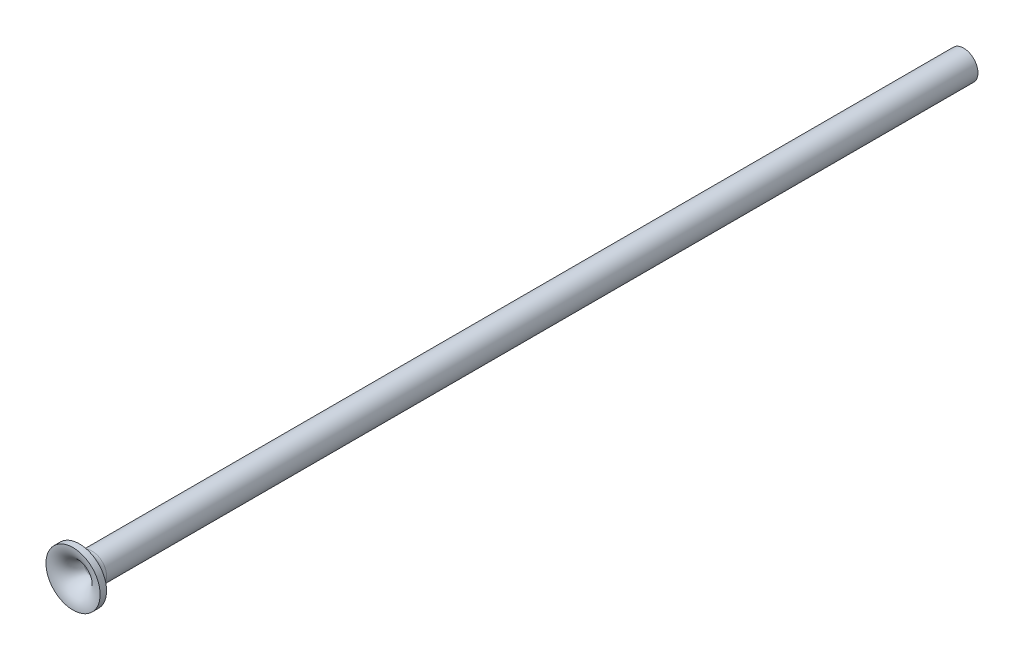
ISO-10303-21;
HEADER;
FILE_DESCRIPTION(('STEP AP214'),'2;1');
FILE_NAME('part.step','',(''),(''),'','','');
FILE_SCHEMA(('AUTOMOTIVE_DESIGN { 1 0 10303 214 1 1 1 1 }'));
ENDSEC;
DATA;
#1=APPLICATION_CONTEXT('core data for automotive mechanical design processes');
#2=APPLICATION_PROTOCOL_DEFINITION('international standard','automotive_design',2000,#1);
#3=PRODUCT_CONTEXT('',#1,'mechanical');
#4=PRODUCT('Part','Part','',(#3));
#5=PRODUCT_RELATED_PRODUCT_CATEGORY('part','',(#4));
#6=PRODUCT_DEFINITION_FORMATION('','',#4);
#7=PRODUCT_DEFINITION_CONTEXT('part definition',#1,'design');
#8=PRODUCT_DEFINITION('design','',#6,#7);
#9=PRODUCT_DEFINITION_SHAPE('','',#8);
#10=(LENGTH_UNIT() NAMED_UNIT(*) SI_UNIT(.MILLI.,.METRE.));
#11=(NAMED_UNIT(*) PLANE_ANGLE_UNIT() SI_UNIT($,.RADIAN.));
#12=(NAMED_UNIT(*) SI_UNIT($,.STERADIAN.) SOLID_ANGLE_UNIT());
#13=UNCERTAINTY_MEASURE_WITH_UNIT(LENGTH_MEASURE(1.E-05),#10,'distance_accuracy_value','');
#14=(GEOMETRIC_REPRESENTATION_CONTEXT(3) GLOBAL_UNCERTAINTY_ASSIGNED_CONTEXT((#13)) GLOBAL_UNIT_ASSIGNED_CONTEXT((#10,
#11,#12)) REPRESENTATION_CONTEXT('',''));
#15=CARTESIAN_POINT('',(0.,0.,0.));
#16=DIRECTION('',(0.,0.,1.));
#17=DIRECTION('',(1.,0.,0.));
#18=AXIS2_PLACEMENT_3D('',#15,#16,#17);
#19=CARTESIAN_POINT('',(0.,0.,0.));
#20=DIRECTION('',(0.,0.,1.));
#21=DIRECTION('',(1.,0.,0.));
#22=AXIS2_PLACEMENT_3D('',#19,#20,#21);
#23=TOROIDAL_SURFACE('',#22,3.,2.125);
#24=CARTESIAN_POINT('',(0.,0.,0.));
#25=DIRECTION('',(0.,0.,1.));
#26=DIRECTION('',(1.,0.,0.));
#27=AXIS2_PLACEMENT_3D('',#24,#25,#26);
#28=CIRCLE('',#27,0.875);
#29=CARTESIAN_POINT('',(0.875,0.,0.));
#30=VERTEX_POINT('',#29);
#31=EDGE_CURVE('E53',#30,#30,#28,.T.);
#32=ORIENTED_EDGE('',*,*,#31,.F.);
#33=EDGE_LOOP('',(#32));
#34=FACE_BOUND('',#33,.T.);
#35=CARTESIAN_POINT('',(0.,0.,2.125));
#36=DIRECTION('',(0.,0.,1.));
#37=DIRECTION('',(1.,0.,0.));
#38=AXIS2_PLACEMENT_3D('',#35,#36,#37);
#39=CIRCLE('',#38,3.);
#40=CARTESIAN_POINT('',(3.,0.,2.125));
#41=VERTEX_POINT('',#40);
#42=EDGE_CURVE('E10',#41,#41,#39,.T.);
#43=ORIENTED_EDGE('',*,*,#42,.T.);
#44=EDGE_LOOP('',(#43));
#45=FACE_BOUND('',#44,.T.);
#46=ADVANCED_FACE('F31',(#34,#45),#23,.T.);
#47=CARTESIAN_POINT('',(0.,0.,0.));
#48=DIRECTION('',(0.,0.,1.));
#49=DIRECTION('',(1.,0.,0.));
#50=AXIS2_PLACEMENT_3D('',#47,#48,#49);
#51=CYLINDRICAL_SURFACE('',#50,3.);
#52=ORIENTED_EDGE('',*,*,#42,.F.);
#53=EDGE_LOOP('',(#52));
#54=FACE_BOUND('',#53,.T.);
#55=CARTESIAN_POINT('',(0.,0.,1.4125));
#56=DIRECTION('',(0.,0.,1.));
#57=DIRECTION('',(1.,0.,0.));
#58=AXIS2_PLACEMENT_3D('',#55,#56,#57);
#59=CIRCLE('',#58,3.);
#60=CARTESIAN_POINT('',(3.,0.,1.4125));
#61=VERTEX_POINT('',#60);
#62=EDGE_CURVE('E37',#61,#61,#59,.T.);
#63=ORIENTED_EDGE('',*,*,#62,.T.);
#64=EDGE_LOOP('',(#63));
#65=FACE_BOUND('',#64,.T.);
#66=ADVANCED_FACE('F60',(#54,#65),#51,.T.);
#67=CARTESIAN_POINT('',(0.,0.,0.));
#68=DIRECTION('',(0.,0.,1.));
#69=DIRECTION('',(1.,0.,0.));
#70=AXIS2_PLACEMENT_3D('',#67,#68,#69);
#71=TOROIDAL_SURFACE('',#70,3.,1.4125);
#72=ORIENTED_EDGE('',*,*,#62,.F.);
#73=EDGE_LOOP('',(#72));
#74=FACE_BOUND('',#73,.T.);
#75=CARTESIAN_POINT('',(0.,0.,0.));
#76=DIRECTION('',(0.,0.,1.));
#77=DIRECTION('',(1.,0.,0.));
#78=AXIS2_PLACEMENT_3D('',#75,#76,#77);
#79=CIRCLE('',#78,1.5875);
#80=CARTESIAN_POINT('',(1.5875,0.,0.));
#81=VERTEX_POINT('',#80);
#82=EDGE_CURVE('E41',#81,#81,#79,.T.);
#83=ORIENTED_EDGE('',*,*,#82,.T.);
#84=EDGE_LOOP('',(#83));
#85=FACE_BOUND('',#84,.T.);
#86=ADVANCED_FACE('F64',(#74,#85),#71,.F.);
#87=CARTESIAN_POINT('',(0.,0.,0.));
#88=DIRECTION('',(0.,0.,1.));
#89=DIRECTION('',(1.,0.,0.));
#90=AXIS2_PLACEMENT_3D('',#87,#88,#89);
#91=CYLINDRICAL_SURFACE('',#90,1.5875);
#92=ORIENTED_EDGE('',*,*,#82,.F.);
#93=EDGE_LOOP('',(#92));
#94=FACE_BOUND('',#93,.T.);
#95=CARTESIAN_POINT('',(0.,0.,-96.5));
#96=DIRECTION('',(0.,0.,1.));
#97=DIRECTION('',(1.,0.,0.));
#98=AXIS2_PLACEMENT_3D('',#95,#96,#97);
#99=CIRCLE('',#98,1.5875);
#100=CARTESIAN_POINT('',(1.5875,0.,-96.5));
#101=VERTEX_POINT('',#100);
#102=EDGE_CURVE('E45',#101,#101,#99,.T.);
#103=ORIENTED_EDGE('',*,*,#102,.T.);
#104=EDGE_LOOP('',(#103));
#105=FACE_BOUND('',#104,.T.);
#106=ADVANCED_FACE('F69',(#94,#105),#91,.T.);
#107=CARTESIAN_POINT('',(-1.5875,0.,-96.5));
#108=DIRECTION('',(0.,0.,1.));
#109=DIRECTION('',(1.,0.,0.));
#110=AXIS2_PLACEMENT_3D('',#107,#108,#109);
#111=PLANE('',#110);
#112=ORIENTED_EDGE('',*,*,#102,.F.);
#113=EDGE_LOOP('',(#112));
#114=FACE_BOUND('',#113,.T.);
#115=CARTESIAN_POINT('',(0.,0.,-96.5));
#116=DIRECTION('',(0.,0.,1.));
#117=DIRECTION('',(1.,0.,0.));
#118=AXIS2_PLACEMENT_3D('',#115,#116,#117);
#119=CIRCLE('',#118,0.875);
#120=CARTESIAN_POINT('',(0.875,0.,-96.5));
#121=VERTEX_POINT('',#120);
#122=EDGE_CURVE('E50',#121,#121,#119,.T.);
#123=ORIENTED_EDGE('',*,*,#122,.T.);
#124=EDGE_LOOP('',(#123));
#125=FACE_BOUND('',#124,.T.);
#126=ADVANCED_FACE('F75',(#114,#125),#111,.F.);
#127=CARTESIAN_POINT('',(0.,0.,0.));
#128=DIRECTION('',(0.,0.,1.));
#129=DIRECTION('',(1.,0.,0.));
#130=AXIS2_PLACEMENT_3D('',#127,#128,#129);
#131=CYLINDRICAL_SURFACE('',#130,0.875);
#132=ORIENTED_EDGE('',*,*,#122,.F.);
#133=EDGE_LOOP('',(#132));
#134=FACE_BOUND('',#133,.T.);
#135=ORIENTED_EDGE('',*,*,#31,.T.);
#136=EDGE_LOOP('',(#135));
#137=FACE_BOUND('',#136,.T.);
#138=ADVANCED_FACE('F57',(#134,#137),#131,.F.);
#139=CLOSED_SHELL('',(#46,#66,#86,#106,#126,#138));
#140=MANIFOLD_SOLID_BREP('B2',#139);
#141=ADVANCED_BREP_SHAPE_REPRESENTATION('',(#18,#140),#14);
#142=SHAPE_DEFINITION_REPRESENTATION(#9,#141);
ENDSEC;
END-ISO-10303-21;
